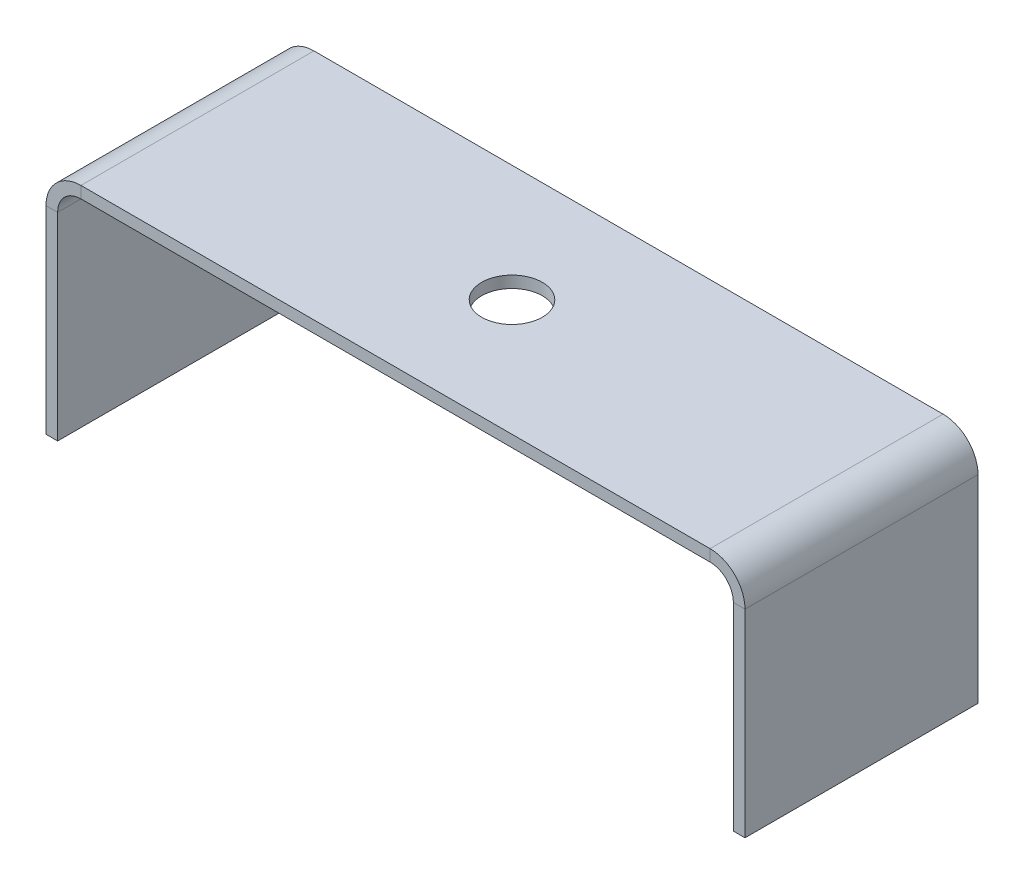
ISO-10303-21;
HEADER;
FILE_DESCRIPTION(('STEP AP214'),'2;1');
FILE_NAME('part.step','',(''),(''),'','','');
FILE_SCHEMA(('AUTOMOTIVE_DESIGN { 1 0 10303 214 1 1 1 1 }'));
ENDSEC;
DATA;
#1=APPLICATION_CONTEXT('core data for automotive mechanical design processes');
#2=APPLICATION_PROTOCOL_DEFINITION('international standard','automotive_design',2000,#1);
#3=PRODUCT_CONTEXT('',#1,'mechanical');
#4=PRODUCT('Part','Part','',(#3));
#5=PRODUCT_RELATED_PRODUCT_CATEGORY('part','',(#4));
#6=PRODUCT_DEFINITION_FORMATION('','',#4);
#7=PRODUCT_DEFINITION_CONTEXT('part definition',#1,'design');
#8=PRODUCT_DEFINITION('design','',#6,#7);
#9=PRODUCT_DEFINITION_SHAPE('','',#8);
#10=(LENGTH_UNIT() NAMED_UNIT(*) SI_UNIT(.MILLI.,.METRE.));
#11=(NAMED_UNIT(*) PLANE_ANGLE_UNIT() SI_UNIT($,.RADIAN.));
#12=(NAMED_UNIT(*) SI_UNIT($,.STERADIAN.) SOLID_ANGLE_UNIT());
#13=UNCERTAINTY_MEASURE_WITH_UNIT(LENGTH_MEASURE(1.E-05),#10,'distance_accuracy_value','');
#14=(GEOMETRIC_REPRESENTATION_CONTEXT(3) GLOBAL_UNCERTAINTY_ASSIGNED_CONTEXT((#13)) GLOBAL_UNIT_ASSIGNED_CONTEXT((#10,
#11,#12)) REPRESENTATION_CONTEXT('',''));
#15=CARTESIAN_POINT('',(0.,0.,0.));
#16=DIRECTION('',(0.,0.,1.));
#17=DIRECTION('',(1.,0.,0.));
#18=AXIS2_PLACEMENT_3D('',#15,#16,#17);
#19=CARTESIAN_POINT('',(0.,17.,20.));
#20=DIRECTION('',(0.,0.,1.));
#21=DIRECTION('',(1.,0.,0.));
#22=AXIS2_PLACEMENT_3D('',#19,#20,#21);
#23=PLANE('',#22);
#24=DIRECTION('',(-1.,0.,0.));
#25=VECTOR('',#24,1.);
#26=CARTESIAN_POINT('',(0.,17.,20.));
#27=LINE('',#26,#25);
#28=CARTESIAN_POINT('',(0.,17.,20.));
#29=VERTEX_POINT('',#28);
#30=CARTESIAN_POINT('',(-1.,17.,20.));
#31=VERTEX_POINT('',#30);
#32=EDGE_CURVE('E11',#29,#31,#27,.T.);
#33=ORIENTED_EDGE('',*,*,#32,.F.);
#34=CARTESIAN_POINT('',(-3.,17.,20.));
#35=DIRECTION('',(0.,0.,-1.));
#36=DIRECTION('',(-1.,0.,0.));
#37=AXIS2_PLACEMENT_3D('',#34,#35,#36);
#38=CIRCLE('',#37,3.);
#39=CARTESIAN_POINT('',(-3.,20.,20.));
#40=VERTEX_POINT('',#39);
#41=EDGE_CURVE('E143',#29,#40,#38,.F.);
#42=ORIENTED_EDGE('',*,*,#41,.T.);
#43=DIRECTION('',(0.,1.,0.));
#44=VECTOR('',#43,1.);
#45=CARTESIAN_POINT('',(-3.,19.,20.));
#46=LINE('',#45,#44);
#47=CARTESIAN_POINT('',(-3.,19.,20.));
#48=VERTEX_POINT('',#47);
#49=EDGE_CURVE('E41',#48,#40,#46,.T.);
#50=ORIENTED_EDGE('',*,*,#49,.F.);
#51=CARTESIAN_POINT('',(-3.,17.,20.));
#52=DIRECTION('',(0.,0.,1.));
#53=DIRECTION('',(1.,0.,0.));
#54=AXIS2_PLACEMENT_3D('',#51,#52,#53);
#55=CIRCLE('',#54,2.);
#56=EDGE_CURVE('E238',#31,#48,#55,.T.);
#57=ORIENTED_EDGE('',*,*,#56,.F.);
#58=EDGE_LOOP('',(#33,#42,#50,#57));
#59=FACE_BOUND('',#58,.T.);
#60=ADVANCED_FACE('F33',(#59),#23,.T.);
#61=CARTESIAN_POINT('',(-3.,19.,20.));
#62=DIRECTION('',(0.,0.,1.));
#63=DIRECTION('',(1.,0.,0.));
#64=AXIS2_PLACEMENT_3D('',#61,#62,#63);
#65=PLANE('',#64);
#66=DIRECTION('',(0.,1.,0.));
#67=VECTOR('',#66,1.);
#68=CARTESIAN_POINT('',(0.,0.,20.));
#69=LINE('',#68,#67);
#70=CARTESIAN_POINT('',(0.,0.,20.));
#71=VERTEX_POINT('',#70);
#72=EDGE_CURVE('E148',#71,#29,#69,.T.);
#73=ORIENTED_EDGE('',*,*,#72,.T.);
#74=ORIENTED_EDGE('',*,*,#32,.T.);
#75=DIRECTION('',(0.,1.,0.));
#76=VECTOR('',#75,1.);
#77=CARTESIAN_POINT('',(-1.,0.,20.));
#78=LINE('',#77,#76);
#79=CARTESIAN_POINT('',(-1.,0.,20.));
#80=VERTEX_POINT('',#79);
#81=EDGE_CURVE('E251',#80,#31,#78,.T.);
#82=ORIENTED_EDGE('',*,*,#81,.F.);
#83=DIRECTION('',(-1.,0.,0.));
#84=VECTOR('',#83,1.);
#85=CARTESIAN_POINT('',(0.,0.,20.));
#86=LINE('',#85,#84);
#87=EDGE_CURVE('E253',#71,#80,#86,.T.);
#88=ORIENTED_EDGE('',*,*,#87,.F.);
#89=EDGE_LOOP('',(#73,#74,#82,#88));
#90=FACE_BOUND('',#89,.T.);
#91=ADVANCED_FACE('F264',(#90),#65,.T.);
#92=CARTESIAN_POINT('',(-3.,20.,0.));
#93=DIRECTION('',(0.,0.,-1.));
#94=DIRECTION('',(-1.,0.,0.));
#95=AXIS2_PLACEMENT_3D('',#92,#93,#94);
#96=PLANE('',#95);
#97=DIRECTION('',(0.,-1.,0.));
#98=VECTOR('',#97,1.);
#99=CARTESIAN_POINT('',(-3.,20.,0.));
#100=LINE('',#99,#98);
#101=CARTESIAN_POINT('',(-3.,20.,0.));
#102=VERTEX_POINT('',#101);
#103=CARTESIAN_POINT('',(-3.,19.,0.));
#104=VERTEX_POINT('',#103);
#105=EDGE_CURVE('E141',#102,#104,#100,.T.);
#106=ORIENTED_EDGE('',*,*,#105,.F.);
#107=CARTESIAN_POINT('',(-3.,17.,0.));
#108=DIRECTION('',(0.,0.,-1.));
#109=DIRECTION('',(-1.,0.,0.));
#110=AXIS2_PLACEMENT_3D('',#107,#108,#109);
#111=CIRCLE('',#110,3.);
#112=CARTESIAN_POINT('',(0.,17.,0.));
#113=VERTEX_POINT('',#112);
#114=EDGE_CURVE('E155',#113,#102,#111,.F.);
#115=ORIENTED_EDGE('',*,*,#114,.F.);
#116=DIRECTION('',(1.,0.,0.));
#117=VECTOR('',#116,1.);
#118=CARTESIAN_POINT('',(-1.,17.,0.));
#119=LINE('',#118,#117);
#120=CARTESIAN_POINT('',(-1.,17.,0.));
#121=VERTEX_POINT('',#120);
#122=EDGE_CURVE('E229',#121,#113,#119,.T.);
#123=ORIENTED_EDGE('',*,*,#122,.F.);
#124=CARTESIAN_POINT('',(-3.,17.,0.));
#125=DIRECTION('',(0.,0.,1.));
#126=DIRECTION('',(1.,0.,0.));
#127=AXIS2_PLACEMENT_3D('',#124,#125,#126);
#128=CIRCLE('',#127,2.);
#129=EDGE_CURVE('E183',#121,#104,#128,.T.);
#130=ORIENTED_EDGE('',*,*,#129,.T.);
#131=EDGE_LOOP('',(#106,#115,#123,#130));
#132=FACE_BOUND('',#131,.T.);
#133=ADVANCED_FACE('F243',(#132),#96,.T.);
#134=CARTESIAN_POINT('',(-1.,17.,0.));
#135=DIRECTION('',(0.,0.,-1.));
#136=DIRECTION('',(-1.,0.,0.));
#137=AXIS2_PLACEMENT_3D('',#134,#135,#136);
#138=PLANE('',#137);
#139=DIRECTION('',(-1.,0.,0.));
#140=VECTOR('',#139,1.);
#141=CARTESIAN_POINT('',(0.,20.,0.));
#142=LINE('',#141,#140);
#143=CARTESIAN_POINT('',(-57.,20.,0.));
#144=VERTEX_POINT('',#143);
#145=EDGE_CURVE('E196',#102,#144,#142,.T.);
#146=ORIENTED_EDGE('',*,*,#145,.F.);
#147=ORIENTED_EDGE('',*,*,#105,.T.);
#148=DIRECTION('',(-1.,0.,0.));
#149=VECTOR('',#148,1.);
#150=CARTESIAN_POINT('',(0.,19.,0.));
#151=LINE('',#150,#149);
#152=CARTESIAN_POINT('',(-57.,19.,0.));
#153=VERTEX_POINT('',#152);
#154=EDGE_CURVE('E181',#104,#153,#151,.T.);
#155=ORIENTED_EDGE('',*,*,#154,.T.);
#156=DIRECTION('',(0.,1.,0.));
#157=VECTOR('',#156,1.);
#158=CARTESIAN_POINT('',(-57.,19.,0.));
#159=LINE('',#158,#157);
#160=EDGE_CURVE('E90',#153,#144,#159,.T.);
#161=ORIENTED_EDGE('',*,*,#160,.T.);
#162=EDGE_LOOP('',(#146,#147,#155,#161));
#163=FACE_BOUND('',#162,.T.);
#164=ADVANCED_FACE('F231',(#163),#138,.T.);
#165=CARTESIAN_POINT('',(-57.,20.,20.));
#166=DIRECTION('',(0.,0.,1.));
#167=DIRECTION('',(1.,0.,0.));
#168=AXIS2_PLACEMENT_3D('',#165,#166,#167);
#169=PLANE('',#168);
#170=DIRECTION('',(0.,-1.,0.));
#171=VECTOR('',#170,1.);
#172=CARTESIAN_POINT('',(-57.,20.,20.));
#173=LINE('',#172,#171);
#174=CARTESIAN_POINT('',(-57.,20.,20.));
#175=VERTEX_POINT('',#174);
#176=CARTESIAN_POINT('',(-57.,19.,20.));
#177=VERTEX_POINT('',#176);
#178=EDGE_CURVE('E227',#175,#177,#173,.T.);
#179=ORIENTED_EDGE('',*,*,#178,.F.);
#180=CARTESIAN_POINT('',(-57.,17.,20.));
#181=DIRECTION('',(0.,0.,-1.));
#182=DIRECTION('',(-1.,0.,0.));
#183=AXIS2_PLACEMENT_3D('',#180,#181,#182);
#184=CIRCLE('',#183,3.);
#185=CARTESIAN_POINT('',(-60.,17.,20.));
#186=VERTEX_POINT('',#185);
#187=EDGE_CURVE('E163',#175,#186,#184,.F.);
#188=ORIENTED_EDGE('',*,*,#187,.T.);
#189=DIRECTION('',(-1.,0.,0.));
#190=VECTOR('',#189,1.);
#191=CARTESIAN_POINT('',(-59.,17.,20.));
#192=LINE('',#191,#190);
#193=CARTESIAN_POINT('',(-59.,17.,20.));
#194=VERTEX_POINT('',#193);
#195=EDGE_CURVE('E49',#194,#186,#192,.T.);
#196=ORIENTED_EDGE('',*,*,#195,.F.);
#197=CARTESIAN_POINT('',(-57.,17.,20.));
#198=DIRECTION('',(0.,0.,1.));
#199=DIRECTION('',(1.,0.,0.));
#200=AXIS2_PLACEMENT_3D('',#197,#198,#199);
#201=CIRCLE('',#200,2.);
#202=EDGE_CURVE('E255',#177,#194,#201,.T.);
#203=ORIENTED_EDGE('',*,*,#202,.F.);
#204=EDGE_LOOP('',(#179,#188,#196,#203));
#205=FACE_BOUND('',#204,.T.);
#206=ADVANCED_FACE('F290',(#205),#169,.T.);
#207=CARTESIAN_POINT('',(-59.,17.,20.));
#208=DIRECTION('',(0.,0.,1.));
#209=DIRECTION('',(1.,0.,0.));
#210=AXIS2_PLACEMENT_3D('',#207,#208,#209);
#211=PLANE('',#210);
#212=DIRECTION('',(-1.,0.,0.));
#213=VECTOR('',#212,1.);
#214=CARTESIAN_POINT('',(0.,20.,20.));
#215=LINE('',#214,#213);
#216=EDGE_CURVE('E133',#40,#175,#215,.T.);
#217=ORIENTED_EDGE('',*,*,#216,.T.);
#218=ORIENTED_EDGE('',*,*,#178,.T.);
#219=DIRECTION('',(-1.,0.,0.));
#220=VECTOR('',#219,1.);
#221=CARTESIAN_POINT('',(0.,19.,20.));
#222=LINE('',#221,#220);
#223=EDGE_CURVE('E136',#48,#177,#222,.T.);
#224=ORIENTED_EDGE('',*,*,#223,.F.);
#225=ORIENTED_EDGE('',*,*,#49,.T.);
#226=EDGE_LOOP('',(#217,#218,#224,#225));
#227=FACE_BOUND('',#226,.T.);
#228=ADVANCED_FACE('F131',(#227),#211,.T.);
#229=CARTESIAN_POINT('',(-60.,17.,0.));
#230=DIRECTION('',(0.,0.,-1.));
#231=DIRECTION('',(-1.,0.,0.));
#232=AXIS2_PLACEMENT_3D('',#229,#230,#231);
#233=PLANE('',#232);
#234=DIRECTION('',(1.,0.,0.));
#235=VECTOR('',#234,1.);
#236=CARTESIAN_POINT('',(-60.,17.,0.));
#237=LINE('',#236,#235);
#238=CARTESIAN_POINT('',(-60.,17.,0.));
#239=VERTEX_POINT('',#238);
#240=CARTESIAN_POINT('',(-59.,17.,0.));
#241=VERTEX_POINT('',#240);
#242=EDGE_CURVE('E97',#239,#241,#237,.T.);
#243=ORIENTED_EDGE('',*,*,#242,.F.);
#244=CARTESIAN_POINT('',(-57.,17.,0.));
#245=DIRECTION('',(0.,0.,-1.));
#246=DIRECTION('',(-1.,0.,0.));
#247=AXIS2_PLACEMENT_3D('',#244,#245,#246);
#248=CIRCLE('',#247,3.);
#249=EDGE_CURVE('E198',#144,#239,#248,.F.);
#250=ORIENTED_EDGE('',*,*,#249,.F.);
#251=ORIENTED_EDGE('',*,*,#160,.F.);
#252=CARTESIAN_POINT('',(-57.,17.,0.));
#253=DIRECTION('',(0.,0.,1.));
#254=DIRECTION('',(1.,0.,0.));
#255=AXIS2_PLACEMENT_3D('',#252,#253,#254);
#256=CIRCLE('',#255,2.);
#257=EDGE_CURVE('E179',#153,#241,#256,.T.);
#258=ORIENTED_EDGE('',*,*,#257,.T.);
#259=EDGE_LOOP('',(#243,#250,#251,#258));
#260=FACE_BOUND('',#259,.T.);
#261=ADVANCED_FACE('F296',(#260),#233,.T.);
#262=CARTESIAN_POINT('',(-57.,19.,0.));
#263=DIRECTION('',(0.,0.,-1.));
#264=DIRECTION('',(-1.,0.,0.));
#265=AXIS2_PLACEMENT_3D('',#262,#263,#264);
#266=PLANE('',#265);
#267=DIRECTION('',(0.,-1.,0.));
#268=VECTOR('',#267,1.);
#269=CARTESIAN_POINT('',(-60.,20.,0.));
#270=LINE('',#269,#268);
#271=CARTESIAN_POINT('',(-60.,0.,0.));
#272=VERTEX_POINT('',#271);
#273=EDGE_CURVE('E169',#239,#272,#270,.T.);
#274=ORIENTED_EDGE('',*,*,#273,.F.);
#275=ORIENTED_EDGE('',*,*,#242,.T.);
#276=DIRECTION('',(0.,-1.,0.));
#277=VECTOR('',#276,1.);
#278=CARTESIAN_POINT('',(-59.,20.,0.));
#279=LINE('',#278,#277);
#280=CARTESIAN_POINT('',(-59.,0.,0.));
#281=VERTEX_POINT('',#280);
#282=EDGE_CURVE('E176',#241,#281,#279,.T.);
#283=ORIENTED_EDGE('',*,*,#282,.T.);
#284=DIRECTION('',(-1.,0.,0.));
#285=VECTOR('',#284,1.);
#286=CARTESIAN_POINT('',(-59.,0.,0.));
#287=LINE('',#286,#285);
#288=EDGE_CURVE('E172',#281,#272,#287,.T.);
#289=ORIENTED_EDGE('',*,*,#288,.T.);
#290=EDGE_LOOP('',(#274,#275,#283,#289));
#291=FACE_BOUND('',#290,.T.);
#292=ADVANCED_FACE('F299',(#291),#266,.T.);
#293=CARTESIAN_POINT('',(-60.,20.,20.));
#294=DIRECTION('',(1.,0.,0.));
#295=DIRECTION('',(0.,1.,0.));
#296=AXIS2_PLACEMENT_3D('',#293,#294,#295);
#297=PLANE('',#296);
#298=ORIENTED_EDGE('',*,*,#273,.T.);
#299=DIRECTION('',(0.,0.,-1.));
#300=VECTOR('',#299,1.);
#301=CARTESIAN_POINT('',(-60.,0.,20.));
#302=LINE('',#301,#300);
#303=CARTESIAN_POINT('',(-60.,0.,20.));
#304=VERTEX_POINT('',#303);
#305=EDGE_CURVE('E222',#304,#272,#302,.T.);
#306=ORIENTED_EDGE('',*,*,#305,.F.);
#307=DIRECTION('',(0.,-1.,0.));
#308=VECTOR('',#307,1.);
#309=CARTESIAN_POINT('',(-60.,20.,20.));
#310=LINE('',#309,#308);
#311=EDGE_CURVE('E103',#186,#304,#310,.T.);
#312=ORIENTED_EDGE('',*,*,#311,.F.);
#313=DIRECTION('',(0.,0.,-1.));
#314=VECTOR('',#313,1.);
#315=CARTESIAN_POINT('',(-60.,17.,20.));
#316=LINE('',#315,#314);
#317=EDGE_CURVE('E165',#186,#239,#316,.T.);
#318=ORIENTED_EDGE('',*,*,#317,.T.);
#319=EDGE_LOOP('',(#298,#306,#312,#318));
#320=FACE_BOUND('',#319,.T.);
#321=ADVANCED_FACE('F302',(#320),#297,.F.);
#322=CARTESIAN_POINT('',(-59.,0.,20.));
#323=DIRECTION('',(0.,-1.,0.));
#324=DIRECTION('',(0.,0.,-1.));
#325=AXIS2_PLACEMENT_3D('',#322,#323,#324);
#326=PLANE('',#325);
#327=ORIENTED_EDGE('',*,*,#288,.F.);
#328=DIRECTION('',(0.,0.,-1.));
#329=VECTOR('',#328,1.);
#330=CARTESIAN_POINT('',(-59.,0.,20.));
#331=LINE('',#330,#329);
#332=CARTESIAN_POINT('',(-59.,0.,20.));
#333=VERTEX_POINT('',#332);
#334=EDGE_CURVE('E220',#333,#281,#331,.T.);
#335=ORIENTED_EDGE('',*,*,#334,.F.);
#336=DIRECTION('',(-1.,0.,0.));
#337=VECTOR('',#336,1.);
#338=CARTESIAN_POINT('',(-59.,0.,20.));
#339=LINE('',#338,#337);
#340=EDGE_CURVE('E529',#333,#304,#339,.T.);
#341=ORIENTED_EDGE('',*,*,#340,.T.);
#342=ORIENTED_EDGE('',*,*,#305,.T.);
#343=EDGE_LOOP('',(#327,#335,#341,#342));
#344=FACE_BOUND('',#343,.T.);
#345=ADVANCED_FACE('F306',(#344),#326,.T.);
#346=CARTESIAN_POINT('',(-59.,20.,20.));
#347=DIRECTION('',(1.,0.,0.));
#348=DIRECTION('',(0.,1.,0.));
#349=AXIS2_PLACEMENT_3D('',#346,#347,#348);
#350=PLANE('',#349);
#351=ORIENTED_EDGE('',*,*,#282,.F.);
#352=DIRECTION('',(0.,0.,-1.));
#353=VECTOR('',#352,1.);
#354=CARTESIAN_POINT('',(-59.,17.,20.));
#355=LINE('',#354,#353);
#356=EDGE_CURVE('E217',#194,#241,#355,.T.);
#357=ORIENTED_EDGE('',*,*,#356,.F.);
#358=DIRECTION('',(0.,-1.,0.));
#359=VECTOR('',#358,1.);
#360=CARTESIAN_POINT('',(-59.,20.,20.));
#361=LINE('',#360,#359);
#362=EDGE_CURVE('E532',#194,#333,#361,.T.);
#363=ORIENTED_EDGE('',*,*,#362,.T.);
#364=ORIENTED_EDGE('',*,*,#334,.T.);
#365=EDGE_LOOP('',(#351,#357,#363,#364));
#366=FACE_BOUND('',#365,.T.);
#367=ADVANCED_FACE('F310',(#366),#350,.T.);
#368=CARTESIAN_POINT('',(-57.,17.,20.));
#369=DIRECTION('',(0.,0.,-1.));
#370=DIRECTION('',(-1.,0.,0.));
#371=AXIS2_PLACEMENT_3D('',#368,#369,#370);
#372=CYLINDRICAL_SURFACE('',#371,2.);
#373=ORIENTED_EDGE('',*,*,#257,.F.);
#374=DIRECTION('',(0.,0.,-1.));
#375=VECTOR('',#374,1.);
#376=CARTESIAN_POINT('',(-57.,19.,20.));
#377=LINE('',#376,#375);
#378=EDGE_CURVE('E214',#177,#153,#377,.T.);
#379=ORIENTED_EDGE('',*,*,#378,.F.);
#380=ORIENTED_EDGE('',*,*,#202,.T.);
#381=ORIENTED_EDGE('',*,*,#356,.T.);
#382=EDGE_LOOP('',(#373,#379,#380,#381));
#383=FACE_BOUND('',#382,.T.);
#384=ADVANCED_FACE('F314',(#383),#372,.F.);
#385=CARTESIAN_POINT('',(0.,19.,20.));
#386=DIRECTION('',(0.,-1.,0.));
#387=DIRECTION('',(1.,0.,0.));
#388=AXIS2_PLACEMENT_3D('',#385,#386,#387);
#389=PLANE('',#388);
#390=CARTESIAN_POINT('',(-30.,19.,10.));
#391=DIRECTION('',(0.,-1.,0.));
#392=DIRECTION('',(1.,0.,0.));
#393=AXIS2_PLACEMENT_3D('',#390,#391,#392);
#394=CIRCLE('',#393,2.6);
#395=CARTESIAN_POINT('',(-27.4,19.,10.));
#396=VERTEX_POINT('',#395);
#397=EDGE_CURVE('E173',#396,#396,#394,.T.);
#398=ORIENTED_EDGE('',*,*,#397,.F.);
#399=EDGE_LOOP('',(#398));
#400=FACE_BOUND('',#399,.T.);
#401=ORIENTED_EDGE('',*,*,#154,.F.);
#402=DIRECTION('',(0.,0.,-1.));
#403=VECTOR('',#402,1.);
#404=CARTESIAN_POINT('',(-3.,19.,20.));
#405=LINE('',#404,#403);
#406=EDGE_CURVE('E211',#48,#104,#405,.T.);
#407=ORIENTED_EDGE('',*,*,#406,.F.);
#408=ORIENTED_EDGE('',*,*,#223,.T.);
#409=ORIENTED_EDGE('',*,*,#378,.T.);
#410=EDGE_LOOP('',(#401,#407,#408,#409));
#411=FACE_BOUND('',#410,.T.);
#412=ADVANCED_FACE('F240',(#400,#411),#389,.T.);
#413=CARTESIAN_POINT('',(-3.,17.,20.));
#414=DIRECTION('',(0.,0.,-1.));
#415=DIRECTION('',(-1.,0.,0.));
#416=AXIS2_PLACEMENT_3D('',#413,#414,#415);
#417=CYLINDRICAL_SURFACE('',#416,2.);
#418=ORIENTED_EDGE('',*,*,#129,.F.);
#419=DIRECTION('',(0.,0.,-1.));
#420=VECTOR('',#419,1.);
#421=CARTESIAN_POINT('',(-1.,17.,20.));
#422=LINE('',#421,#420);
#423=EDGE_CURVE('E208',#31,#121,#422,.T.);
#424=ORIENTED_EDGE('',*,*,#423,.F.);
#425=ORIENTED_EDGE('',*,*,#56,.T.);
#426=ORIENTED_EDGE('',*,*,#406,.T.);
#427=EDGE_LOOP('',(#418,#424,#425,#426));
#428=FACE_BOUND('',#427,.T.);
#429=ADVANCED_FACE('F236',(#428),#417,.F.);
#430=CARTESIAN_POINT('',(-1.,0.,20.));
#431=DIRECTION('',(-1.,0.,0.));
#432=DIRECTION('',(0.,0.,1.));
#433=AXIS2_PLACEMENT_3D('',#430,#431,#432);
#434=PLANE('',#433);
#435=DIRECTION('',(0.,1.,0.));
#436=VECTOR('',#435,1.);
#437=CARTESIAN_POINT('',(-1.,0.,0.));
#438=LINE('',#437,#436);
#439=CARTESIAN_POINT('',(-1.,0.,0.));
#440=VERTEX_POINT('',#439);
#441=EDGE_CURVE('E186',#440,#121,#438,.T.);
#442=ORIENTED_EDGE('',*,*,#441,.F.);
#443=DIRECTION('',(0.,0.,-1.));
#444=VECTOR('',#443,1.);
#445=CARTESIAN_POINT('',(-1.,0.,20.));
#446=LINE('',#445,#444);
#447=EDGE_CURVE('E206',#80,#440,#446,.T.);
#448=ORIENTED_EDGE('',*,*,#447,.F.);
#449=ORIENTED_EDGE('',*,*,#81,.T.);
#450=ORIENTED_EDGE('',*,*,#423,.T.);
#451=EDGE_LOOP('',(#442,#448,#449,#450));
#452=FACE_BOUND('',#451,.T.);
#453=ADVANCED_FACE('F249',(#452),#434,.T.);
#454=CARTESIAN_POINT('',(0.,0.,20.));
#455=DIRECTION('',(0.,-1.,0.));
#456=DIRECTION('',(0.,0.,-1.));
#457=AXIS2_PLACEMENT_3D('',#454,#455,#456);
#458=PLANE('',#457);
#459=DIRECTION('',(-1.,0.,0.));
#460=VECTOR('',#459,1.);
#461=CARTESIAN_POINT('',(0.,0.,0.));
#462=LINE('',#461,#460);
#463=CARTESIAN_POINT('',(0.,0.,0.));
#464=VERTEX_POINT('',#463);
#465=EDGE_CURVE('E189',#464,#440,#462,.T.);
#466=ORIENTED_EDGE('',*,*,#465,.F.);
#467=DIRECTION('',(0.,0.,-1.));
#468=VECTOR('',#467,1.);
#469=CARTESIAN_POINT('',(0.,0.,20.));
#470=LINE('',#469,#468);
#471=EDGE_CURVE('E204',#71,#464,#470,.T.);
#472=ORIENTED_EDGE('',*,*,#471,.F.);
#473=ORIENTED_EDGE('',*,*,#87,.T.);
#474=ORIENTED_EDGE('',*,*,#447,.T.);
#475=EDGE_LOOP('',(#466,#472,#473,#474));
#476=FACE_BOUND('',#475,.T.);
#477=ADVANCED_FACE('F270',(#476),#458,.T.);
#478=CARTESIAN_POINT('',(0.,0.,20.));
#479=DIRECTION('',(-1.,0.,0.));
#480=DIRECTION('',(0.,0.,1.));
#481=AXIS2_PLACEMENT_3D('',#478,#479,#480);
#482=PLANE('',#481);
#483=DIRECTION('',(0.,1.,0.));
#484=VECTOR('',#483,1.);
#485=CARTESIAN_POINT('',(0.,0.,0.));
#486=LINE('',#485,#484);
#487=EDGE_CURVE('E192',#464,#113,#486,.T.);
#488=ORIENTED_EDGE('',*,*,#487,.T.);
#489=DIRECTION('',(0.,0.,-1.));
#490=VECTOR('',#489,1.);
#491=CARTESIAN_POINT('',(0.,17.,20.));
#492=LINE('',#491,#490);
#493=EDGE_CURVE('E157',#29,#113,#492,.T.);
#494=ORIENTED_EDGE('',*,*,#493,.F.);
#495=ORIENTED_EDGE('',*,*,#72,.F.);
#496=ORIENTED_EDGE('',*,*,#471,.T.);
#497=EDGE_LOOP('',(#488,#494,#495,#496));
#498=FACE_BOUND('',#497,.T.);
#499=ADVANCED_FACE('F266',(#498),#482,.F.);
#500=CARTESIAN_POINT('',(-3.,17.,20.));
#501=DIRECTION('',(0.,0.,-1.));
#502=DIRECTION('',(-1.,0.,0.));
#503=AXIS2_PLACEMENT_3D('',#500,#501,#502);
#504=CYLINDRICAL_SURFACE('',#503,3.);
#505=ORIENTED_EDGE('',*,*,#114,.T.);
#506=DIRECTION('',(0.,0.,-1.));
#507=VECTOR('',#506,1.);
#508=CARTESIAN_POINT('',(-3.,20.,20.));
#509=LINE('',#508,#507);
#510=EDGE_CURVE('E152',#40,#102,#509,.T.);
#511=ORIENTED_EDGE('',*,*,#510,.F.);
#512=ORIENTED_EDGE('',*,*,#41,.F.);
#513=ORIENTED_EDGE('',*,*,#493,.T.);
#514=EDGE_LOOP('',(#505,#511,#512,#513));
#515=FACE_BOUND('',#514,.T.);
#516=ADVANCED_FACE('F153',(#515),#504,.T.);
#517=CARTESIAN_POINT('',(0.,20.,20.));
#518=DIRECTION('',(0.,-1.,0.));
#519=DIRECTION('',(1.,0.,0.));
#520=AXIS2_PLACEMENT_3D('',#517,#518,#519);
#521=PLANE('',#520);
#522=CARTESIAN_POINT('',(-30.,20.,10.));
#523=DIRECTION('',(0.,1.,0.));
#524=DIRECTION('',(-1.,0.,0.));
#525=AXIS2_PLACEMENT_3D('',#522,#523,#524);
#526=CIRCLE('',#525,2.6);
#527=CARTESIAN_POINT('',(-32.6,20.,10.));
#528=VERTEX_POINT('',#527);
#529=EDGE_CURVE('E524',#528,#528,#526,.T.);
#530=ORIENTED_EDGE('',*,*,#529,.F.);
#531=EDGE_LOOP('',(#530));
#532=FACE_BOUND('',#531,.T.);
#533=ORIENTED_EDGE('',*,*,#145,.T.);
#534=DIRECTION('',(0.,0.,-1.));
#535=VECTOR('',#534,1.);
#536=CARTESIAN_POINT('',(-57.,20.,20.));
#537=LINE('',#536,#535);
#538=EDGE_CURVE('E158',#175,#144,#537,.T.);
#539=ORIENTED_EDGE('',*,*,#538,.F.);
#540=ORIENTED_EDGE('',*,*,#216,.F.);
#541=ORIENTED_EDGE('',*,*,#510,.T.);
#542=EDGE_LOOP('',(#533,#539,#540,#541));
#543=FACE_BOUND('',#542,.T.);
#544=ADVANCED_FACE('F160',(#532,#543),#521,.F.);
#545=CARTESIAN_POINT('',(-57.,17.,20.));
#546=DIRECTION('',(0.,0.,-1.));
#547=DIRECTION('',(-1.,0.,0.));
#548=AXIS2_PLACEMENT_3D('',#545,#546,#547);
#549=CYLINDRICAL_SURFACE('',#548,3.);
#550=ORIENTED_EDGE('',*,*,#249,.T.);
#551=ORIENTED_EDGE('',*,*,#317,.F.);
#552=ORIENTED_EDGE('',*,*,#187,.F.);
#553=ORIENTED_EDGE('',*,*,#538,.T.);
#554=EDGE_LOOP('',(#550,#551,#552,#553));
#555=FACE_BOUND('',#554,.T.);
#556=ADVANCED_FACE('F361',(#555),#549,.T.);
#557=CARTESIAN_POINT('',(-57.,17.,20.));
#558=DIRECTION('',(0.,0.,1.));
#559=DIRECTION('',(1.,0.,0.));
#560=AXIS2_PLACEMENT_3D('',#557,#558,#559);
#561=PLANE('',#560);
#562=ORIENTED_EDGE('',*,*,#311,.T.);
#563=ORIENTED_EDGE('',*,*,#340,.F.);
#564=ORIENTED_EDGE('',*,*,#362,.F.);
#565=ORIENTED_EDGE('',*,*,#195,.T.);
#566=EDGE_LOOP('',(#562,#563,#564,#565));
#567=FACE_BOUND('',#566,.T.);
#568=ADVANCED_FACE('F366',(#567),#561,.T.);
#569=CARTESIAN_POINT('',(-57.,17.,0.));
#570=DIRECTION('',(0.,0.,1.));
#571=DIRECTION('',(1.,0.,0.));
#572=AXIS2_PLACEMENT_3D('',#569,#570,#571);
#573=PLANE('',#572);
#574=ORIENTED_EDGE('',*,*,#441,.T.);
#575=ORIENTED_EDGE('',*,*,#122,.T.);
#576=ORIENTED_EDGE('',*,*,#487,.F.);
#577=ORIENTED_EDGE('',*,*,#465,.T.);
#578=EDGE_LOOP('',(#574,#575,#576,#577));
#579=FACE_BOUND('',#578,.T.);
#580=ADVANCED_FACE('F268',(#579),#573,.F.);
#581=CARTESIAN_POINT('',(-30.,10.,10.));
#582=DIRECTION('',(0.,1.,0.));
#583=DIRECTION('',(-1.,0.,0.));
#584=AXIS2_PLACEMENT_3D('',#581,#582,#583);
#585=CYLINDRICAL_SURFACE('',#584,2.6);
#586=ORIENTED_EDGE('',*,*,#397,.T.);
#587=EDGE_LOOP('',(#586));
#588=FACE_BOUND('',#587,.T.);
#589=ORIENTED_EDGE('',*,*,#529,.T.);
#590=EDGE_LOOP('',(#589));
#591=FACE_BOUND('',#590,.T.);
#592=ADVANCED_FACE('F385',(#588,#591),#585,.F.);
#593=CLOSED_SHELL('',(#60,#91,#133,#164,#206,#228,#261,#292,#321,#345,#367,#384,#412,#429,#453,
#477,#499,#516,#544,#556,#568,#580,#592));
#594=MANIFOLD_SOLID_BREP('B2',#593);
#595=ADVANCED_BREP_SHAPE_REPRESENTATION('',(#18,#594),#14);
#596=SHAPE_DEFINITION_REPRESENTATION(#9,#595);
ENDSEC;
END-ISO-10303-21;
